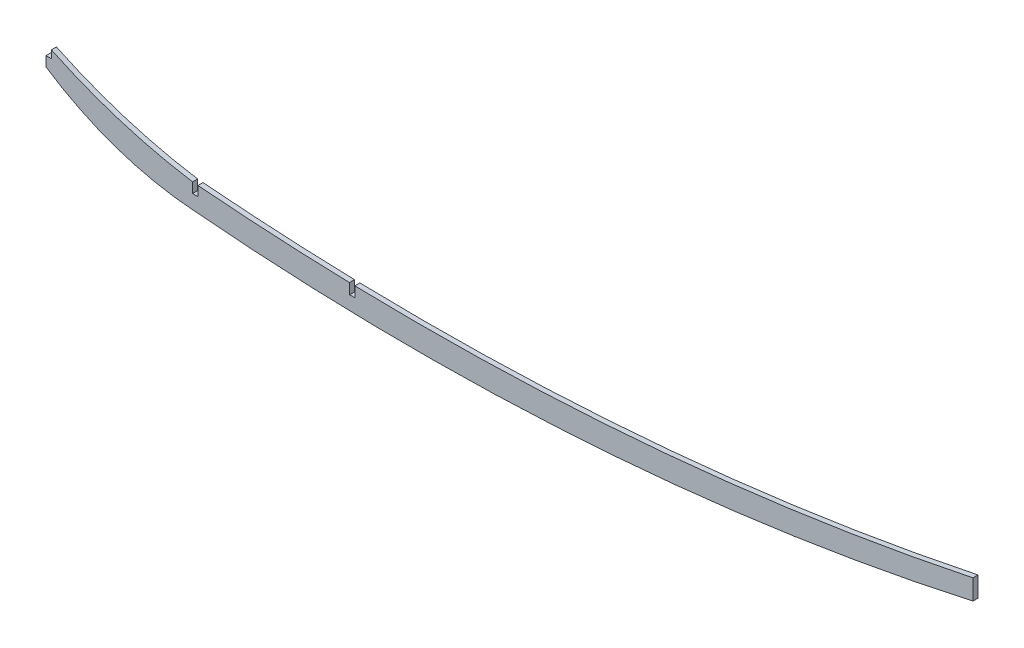
ISO-10303-21;
HEADER;
FILE_DESCRIPTION(('STEP AP214'),'2;1');
FILE_NAME('part.step','',(''),(''),'','','');
FILE_SCHEMA(('AUTOMOTIVE_DESIGN { 1 0 10303 214 1 1 1 1 }'));
ENDSEC;
DATA;
#1=APPLICATION_CONTEXT('core data for automotive mechanical design processes');
#2=APPLICATION_PROTOCOL_DEFINITION('international standard','automotive_design',2000,#1);
#3=PRODUCT_CONTEXT('',#1,'mechanical');
#4=PRODUCT('Part','Part','',(#3));
#5=PRODUCT_RELATED_PRODUCT_CATEGORY('part','',(#4));
#6=PRODUCT_DEFINITION_FORMATION('','',#4);
#7=PRODUCT_DEFINITION_CONTEXT('part definition',#1,'design');
#8=PRODUCT_DEFINITION('design','',#6,#7);
#9=PRODUCT_DEFINITION_SHAPE('','',#8);
#10=(LENGTH_UNIT() NAMED_UNIT(*) SI_UNIT(.MILLI.,.METRE.));
#11=(NAMED_UNIT(*) PLANE_ANGLE_UNIT() SI_UNIT($,.RADIAN.));
#12=(NAMED_UNIT(*) SI_UNIT($,.STERADIAN.) SOLID_ANGLE_UNIT());
#13=UNCERTAINTY_MEASURE_WITH_UNIT(LENGTH_MEASURE(1.E-05),#10,'distance_accuracy_value','');
#14=(GEOMETRIC_REPRESENTATION_CONTEXT(3) GLOBAL_UNCERTAINTY_ASSIGNED_CONTEXT((#13)) GLOBAL_UNIT_ASSIGNED_CONTEXT((#10,
#11,#12)) REPRESENTATION_CONTEXT('',''));
#15=CARTESIAN_POINT('',(0.,0.,0.));
#16=DIRECTION('',(0.,0.,1.));
#17=DIRECTION('',(1.,0.,0.));
#18=AXIS2_PLACEMENT_3D('',#15,#16,#17);
#19=CARTESIAN_POINT('',(236.552383189197,1575.13597472044,1.5875));
#20=DIRECTION('',(0.,0.,-1.));
#21=DIRECTION('',(-1.,0.,0.));
#22=AXIS2_PLACEMENT_3D('',#19,#20,#21);
#23=CYLINDRICAL_SURFACE('',#22,1695.3252939989);
#24=DIRECTION('',(0.,0.,-1.));
#25=VECTOR('',#24,1.);
#26=CARTESIAN_POINT('',(95.6691,-114.325404829356,1.5875));
#27=LINE('',#26,#25);
#28=CARTESIAN_POINT('',(95.6691,-114.325404829356,1.5875));
#29=VERTEX_POINT('',#28);
#30=CARTESIAN_POINT('',(95.6691,-114.325404829356,-1.5875));
#31=VERTEX_POINT('',#30);
#32=EDGE_CURVE('E211',#29,#31,#27,.T.);
#33=ORIENTED_EDGE('',*,*,#32,.F.);
#34=CARTESIAN_POINT('',(236.552383189197,1575.13597472044,1.5875));
#35=DIRECTION('',(0.,0.,1.));
#36=DIRECTION('',(1.,0.,0.));
#37=AXIS2_PLACEMENT_3D('',#34,#35,#36);
#38=CIRCLE('',#37,1695.3252939989);
#39=CARTESIAN_POINT('',(191.016824912201,-119.57767820293,1.5875));
#40=VERTEX_POINT('',#39);
#41=EDGE_CURVE('E210',#29,#40,#38,.T.);
#42=ORIENTED_EDGE('',*,*,#41,.T.);
#43=DIRECTION('',(0.,0.,-1.));
#44=VECTOR('',#43,1.);
#45=CARTESIAN_POINT('',(191.016824912201,-119.57767820293,1.5875));
#46=LINE('',#45,#44);
#47=CARTESIAN_POINT('',(191.016824912201,-119.57767820293,-1.5875));
#48=VERTEX_POINT('',#47);
#49=EDGE_CURVE('E202',#48,#40,#46,.F.);
#50=ORIENTED_EDGE('',*,*,#49,.F.);
#51=CARTESIAN_POINT('',(236.552383189197,1575.13597472044,-1.5875));
#52=DIRECTION('',(0.,0.,1.));
#53=DIRECTION('',(1.,0.,0.));
#54=AXIS2_PLACEMENT_3D('',#51,#52,#53);
#55=CIRCLE('',#54,1695.3252939989);
#56=EDGE_CURVE('E172',#31,#48,#55,.T.);
#57=ORIENTED_EDGE('',*,*,#56,.F.);
#58=EDGE_LOOP('',(#33,#42,#50,#57));
#59=FACE_BOUND('',#58,.T.);
#60=ADVANCED_FACE('F38',(#59),#23,.F.);
#61=DIRECTION('',(0.,0.,-1.));
#62=VECTOR('',#61,1.);
#63=CARTESIAN_POINT('',(194.39759616352,-119.665142344122,1.5875));
#64=LINE('',#63,#62);
#65=CARTESIAN_POINT('',(194.39759616352,-119.665142344123,1.5875));
#66=VERTEX_POINT('',#65);
#67=CARTESIAN_POINT('',(194.39759616352,-119.665142344123,-1.5875));
#68=VERTEX_POINT('',#67);
#69=EDGE_CURVE('E212',#66,#68,#64,.T.);
#70=ORIENTED_EDGE('',*,*,#69,.F.);
#71=CARTESIAN_POINT('',(583.522463963637,-84.3035738982637,1.5875));
#72=VERTEX_POINT('',#71);
#73=EDGE_CURVE('E180',#66,#72,#38,.T.);
#74=ORIENTED_EDGE('',*,*,#73,.T.);
#75=DIRECTION('',(0.,0.,-1.));
#76=VECTOR('',#75,1.);
#77=CARTESIAN_POINT('',(583.522463963637,-84.3035738982637,1.5875));
#78=LINE('',#77,#76);
#79=CARTESIAN_POINT('',(583.522463963637,-84.3035738982637,-1.5875));
#80=VERTEX_POINT('',#79);
#81=EDGE_CURVE('E181',#72,#80,#78,.T.);
#82=ORIENTED_EDGE('',*,*,#81,.T.);
#83=EDGE_CURVE('E222',#68,#80,#55,.T.);
#84=ORIENTED_EDGE('',*,*,#83,.F.);
#85=EDGE_LOOP('',(#70,#74,#82,#84));
#86=FACE_BOUND('',#85,.T.);
#87=ADVANCED_FACE('F40',(#86),#23,.F.);
#88=CARTESIAN_POINT('',(142.023725714652,203.900083427084,1.5875));
#89=DIRECTION('',(0.,0.,-1.));
#90=DIRECTION('',(-1.,0.,0.));
#91=AXIS2_PLACEMENT_3D('',#88,#89,#90);
#92=CYLINDRICAL_SURFACE('',#91,321.799409137231);
#93=DIRECTION('',(0.,0.,-1.));
#94=VECTOR('',#93,1.);
#95=CARTESIAN_POINT('',(3.37819999999972,-86.5001196038001,1.5875));
#96=LINE('',#95,#94);
#97=CARTESIAN_POINT('',(3.37819999999973,-86.5001196038001,1.5875));
#98=VERTEX_POINT('',#97);
#99=CARTESIAN_POINT('',(3.37819999999973,-86.5001196038001,-1.5875));
#100=VERTEX_POINT('',#99);
#101=EDGE_CURVE('E220',#98,#100,#96,.T.);
#102=ORIENTED_EDGE('',*,*,#101,.F.);
#103=CARTESIAN_POINT('',(142.023725714652,203.900083427084,1.5875));
#104=DIRECTION('',(0.,0.,1.));
#105=DIRECTION('',(1.,0.,0.));
#106=AXIS2_PLACEMENT_3D('',#103,#104,#105);
#107=CIRCLE('',#106,321.799409137231);
#108=CARTESIAN_POINT('',(92.2909,-114.033094721261,1.5875));
#109=VERTEX_POINT('',#108);
#110=EDGE_CURVE('E224',#98,#109,#107,.T.);
#111=ORIENTED_EDGE('',*,*,#110,.T.);
#112=DIRECTION('',(0.,0.,-1.));
#113=VECTOR('',#112,1.);
#114=CARTESIAN_POINT('',(92.2909,-114.033094721261,1.5875));
#115=LINE('',#114,#113);
#116=CARTESIAN_POINT('',(92.2909,-114.033094721261,-1.5875));
#117=VERTEX_POINT('',#116);
#118=EDGE_CURVE('E214',#117,#109,#115,.F.);
#119=ORIENTED_EDGE('',*,*,#118,.F.);
#120=CARTESIAN_POINT('',(142.023725714652,203.900083427084,-1.5875));
#121=DIRECTION('',(0.,0.,1.));
#122=DIRECTION('',(1.,0.,0.));
#123=AXIS2_PLACEMENT_3D('',#120,#121,#122);
#124=CIRCLE('',#123,321.799409137231);
#125=EDGE_CURVE('E167',#100,#117,#124,.T.);
#126=ORIENTED_EDGE('',*,*,#125,.F.);
#127=EDGE_LOOP('',(#102,#111,#119,#126));
#128=FACE_BOUND('',#127,.T.);
#129=ADVANCED_FACE('F308',(#128),#92,.F.);
#130=CARTESIAN_POINT('',(-2.22640957886562E-13,0.,1.5875));
#131=DIRECTION('',(-1.,0.,0.));
#132=DIRECTION('',(0.,-1.,0.));
#133=AXIS2_PLACEMENT_3D('',#130,#131,#132);
#134=PLANE('',#133);
#135=DIRECTION('',(0.,0.,1.));
#136=VECTOR('',#135,1.);
#137=CARTESIAN_POINT('',(-2.68898460419739E-13,-91.3400046835682,-1.5875));
#138=LINE('',#137,#136);
#139=CARTESIAN_POINT('',(-2.68898460419739E-13,-91.3400046835682,-1.5875));
#140=VERTEX_POINT('',#139);
#141=CARTESIAN_POINT('',(-2.68898460419739E-13,-91.3400046835682,1.5875));
#142=VERTEX_POINT('',#141);
#143=EDGE_CURVE('E148',#140,#142,#138,.T.);
#144=ORIENTED_EDGE('',*,*,#143,.F.);
#145=DIRECTION('',(0.,1.,0.));
#146=VECTOR('',#145,1.);
#147=CARTESIAN_POINT('',(-2.22640957886562E-13,0.,-1.5875));
#148=LINE('',#147,#146);
#149=CARTESIAN_POINT('',(-2.75821032680312E-13,-97.5630046835681,-1.5875));
#150=VERTEX_POINT('',#149);
#151=EDGE_CURVE('E159',#150,#140,#148,.T.);
#152=ORIENTED_EDGE('',*,*,#151,.F.);
#153=DIRECTION('',(0.,0.,-1.));
#154=VECTOR('',#153,1.);
#155=CARTESIAN_POINT('',(-2.75821032680312E-13,-97.5630046835681,1.5875));
#156=LINE('',#155,#154);
#157=CARTESIAN_POINT('',(-2.75821032680312E-13,-97.5630046835681,1.5875));
#158=VERTEX_POINT('',#157);
#159=EDGE_CURVE('E191',#158,#150,#156,.T.);
#160=ORIENTED_EDGE('',*,*,#159,.F.);
#161=DIRECTION('',(0.,1.,0.));
#162=VECTOR('',#161,1.);
#163=CARTESIAN_POINT('',(-2.22640957886562E-13,0.,1.5875));
#164=LINE('',#163,#162);
#165=EDGE_CURVE('E161',#158,#142,#164,.T.);
#166=ORIENTED_EDGE('',*,*,#165,.T.);
#167=EDGE_LOOP('',(#144,#152,#160,#166));
#168=FACE_BOUND('',#167,.T.);
#169=ADVANCED_FACE('F158',(#168),#134,.T.);
#170=CARTESIAN_POINT('',(106.917579146808,63.4069370940165,1.5875));
#171=DIRECTION('',(0.,0.,-1.));
#172=DIRECTION('',(-1.,0.,0.));
#173=AXIS2_PLACEMENT_3D('',#170,#171,#172);
#174=CYLINDRICAL_SURFACE('',#173,193.242570068018);
#175=CARTESIAN_POINT('',(106.917579146808,63.4069370940165,-1.5875));
#176=DIRECTION('',(0.,0.,1.));
#177=DIRECTION('',(1.,0.,0.));
#178=AXIS2_PLACEMENT_3D('',#175,#176,#177);
#179=CIRCLE('',#178,193.242570068018);
#180=CARTESIAN_POINT('',(92.3925000000007,-129.288970912023,-1.5875));
#181=VERTEX_POINT('',#180);
#182=EDGE_CURVE('E166',#150,#181,#179,.T.);
#183=ORIENTED_EDGE('',*,*,#182,.T.);
#184=DIRECTION('',(0.,0.,-1.));
#185=VECTOR('',#184,1.);
#186=CARTESIAN_POINT('',(92.3925000000007,-129.288970912023,1.5875));
#187=LINE('',#186,#185);
#188=CARTESIAN_POINT('',(92.3925000000007,-129.288970912023,1.5875));
#189=VERTEX_POINT('',#188);
#190=EDGE_CURVE('E188',#189,#181,#187,.T.);
#191=ORIENTED_EDGE('',*,*,#190,.F.);
#192=CARTESIAN_POINT('',(106.917579146808,63.4069370940165,1.5875));
#193=DIRECTION('',(0.,0.,1.));
#194=DIRECTION('',(1.,0.,0.));
#195=AXIS2_PLACEMENT_3D('',#192,#193,#194);
#196=CIRCLE('',#195,193.242570068018);
#197=EDGE_CURVE('E228',#158,#189,#196,.T.);
#198=ORIENTED_EDGE('',*,*,#197,.F.);
#199=ORIENTED_EDGE('',*,*,#159,.T.);
#200=EDGE_LOOP('',(#183,#191,#198,#199));
#201=FACE_BOUND('',#200,.T.);
#202=ADVANCED_FACE('F250',(#201),#174,.T.);
#203=CARTESIAN_POINT('',(233.579462378437,1474.66672504871,1.5875));
#204=DIRECTION('',(0.,0.,-1.));
#205=DIRECTION('',(-1.,0.,0.));
#206=AXIS2_PLACEMENT_3D('',#203,#204,#205);
#207=CYLINDRICAL_SURFACE('',#206,1610.15764226691);
#208=CARTESIAN_POINT('',(233.579462378437,1474.66672504871,-1.5875));
#209=DIRECTION('',(0.,0.,1.));
#210=DIRECTION('',(1.,0.,0.));
#211=AXIS2_PLACEMENT_3D('',#208,#209,#210);
#212=CIRCLE('',#211,1610.15764226691);
#213=CARTESIAN_POINT('',(583.522463963637,-97.0035738982638,-1.5875));
#214=VERTEX_POINT('',#213);
#215=EDGE_CURVE('E169',#181,#214,#212,.T.);
#216=ORIENTED_EDGE('',*,*,#215,.T.);
#217=DIRECTION('',(0.,0.,-1.));
#218=VECTOR('',#217,1.);
#219=CARTESIAN_POINT('',(583.522463963637,-97.0035738982638,1.5875));
#220=LINE('',#219,#218);
#221=CARTESIAN_POINT('',(583.522463963637,-97.0035738982638,1.5875));
#222=VERTEX_POINT('',#221);
#223=EDGE_CURVE('E184',#222,#214,#220,.T.);
#224=ORIENTED_EDGE('',*,*,#223,.F.);
#225=CARTESIAN_POINT('',(233.579462378437,1474.66672504871,1.5875));
#226=DIRECTION('',(0.,0.,1.));
#227=DIRECTION('',(1.,0.,0.));
#228=AXIS2_PLACEMENT_3D('',#225,#226,#227);
#229=CIRCLE('',#228,1610.15764226691);
#230=EDGE_CURVE('E230',#189,#222,#229,.T.);
#231=ORIENTED_EDGE('',*,*,#230,.F.);
#232=ORIENTED_EDGE('',*,*,#190,.T.);
#233=EDGE_LOOP('',(#216,#224,#231,#232));
#234=FACE_BOUND('',#233,.T.);
#235=ADVANCED_FACE('F246',(#234),#207,.T.);
#236=CARTESIAN_POINT('',(583.522463963637,0.,1.5875));
#237=DIRECTION('',(-1.,0.,0.));
#238=DIRECTION('',(0.,0.,1.));
#239=AXIS2_PLACEMENT_3D('',#236,#237,#238);
#240=PLANE('',#239);
#241=DIRECTION('',(0.,1.,0.));
#242=VECTOR('',#241,1.);
#243=CARTESIAN_POINT('',(583.522463963637,0.,-1.5875));
#244=LINE('',#243,#242);
#245=EDGE_CURVE('E177',#214,#80,#244,.T.);
#246=ORIENTED_EDGE('',*,*,#245,.T.);
#247=ORIENTED_EDGE('',*,*,#81,.F.);
#248=DIRECTION('',(0.,1.,0.));
#249=VECTOR('',#248,1.);
#250=CARTESIAN_POINT('',(583.522463963637,0.,1.5875));
#251=LINE('',#250,#249);
#252=EDGE_CURVE('E185',#222,#72,#251,.T.);
#253=ORIENTED_EDGE('',*,*,#252,.F.);
#254=ORIENTED_EDGE('',*,*,#223,.T.);
#255=EDGE_LOOP('',(#246,#247,#253,#254));
#256=FACE_BOUND('',#255,.T.);
#257=ADVANCED_FACE('F242',(#256),#240,.F.);
#258=CARTESIAN_POINT('',(0.,0.,1.5875));
#259=DIRECTION('',(0.,0.,1.));
#260=DIRECTION('',(1.,0.,0.));
#261=AXIS2_PLACEMENT_3D('',#258,#259,#260);
#262=PLANE('',#261);
#263=DIRECTION('',(0.,1.,0.));
#264=VECTOR('',#263,1.);
#265=CARTESIAN_POINT('',(3.37819999999973,-84.8630046835681,1.5875));
#266=LINE('',#265,#264);
#267=CARTESIAN_POINT('',(3.37819999999973,-91.3400046835682,1.5875));
#268=VERTEX_POINT('',#267);
#269=EDGE_CURVE('E153',#268,#98,#266,.T.);
#270=ORIENTED_EDGE('',*,*,#269,.F.);
#271=DIRECTION('',(1.,0.,0.));
#272=VECTOR('',#271,1.);
#273=CARTESIAN_POINT('',(-2.68898460419739E-13,-91.3400046835682,1.5875));
#274=LINE('',#273,#272);
#275=EDGE_CURVE('E254',#142,#268,#274,.T.);
#276=ORIENTED_EDGE('',*,*,#275,.F.);
#277=ORIENTED_EDGE('',*,*,#165,.F.);
#278=ORIENTED_EDGE('',*,*,#197,.T.);
#279=ORIENTED_EDGE('',*,*,#230,.T.);
#280=ORIENTED_EDGE('',*,*,#252,.T.);
#281=ORIENTED_EDGE('',*,*,#73,.F.);
#282=DIRECTION('',(-0.0209302977678912,0.999780937323446,0.));
#283=VECTOR('',#282,1.);
#284=CARTESIAN_POINT('',(194.532828757834,-126.124819669298,1.5875));
#285=LINE('',#284,#283);
#286=CARTESIAN_POINT('',(194.532828757834,-126.124819669298,1.5875));
#287=VERTEX_POINT('',#286);
#288=EDGE_CURVE('E281',#287,#66,#285,.T.);
#289=ORIENTED_EDGE('',*,*,#288,.F.);
#290=DIRECTION('',(0.999780937323446,0.0209302977678943,0.));
#291=VECTOR('',#290,1.);
#292=CARTESIAN_POINT('',(191.155368795368,-126.195526401217,1.5875));
#293=LINE('',#292,#291);
#294=CARTESIAN_POINT('',(191.155368795368,-126.195526401217,1.5875));
#295=VERTEX_POINT('',#294);
#296=EDGE_CURVE('E283',#295,#287,#293,.T.);
#297=ORIENTED_EDGE('',*,*,#296,.F.);
#298=DIRECTION('',(0.0209302977678912,-0.999780937323445,0.));
#299=VECTOR('',#298,1.);
#300=CARTESIAN_POINT('',(191.155368795368,-126.195526401217,1.5875));
#301=LINE('',#300,#299);
#302=EDGE_CURVE('E269',#40,#295,#301,.T.);
#303=ORIENTED_EDGE('',*,*,#302,.F.);
#304=ORIENTED_EDGE('',*,*,#41,.F.);
#305=DIRECTION('',(0.,1.,0.));
#306=VECTOR('',#305,1.);
#307=CARTESIAN_POINT('',(95.6691,-120.415791429802,1.5875));
#308=LINE('',#307,#306);
#309=CARTESIAN_POINT('',(95.6691,-120.415791429802,1.5875));
#310=VERTEX_POINT('',#309);
#311=EDGE_CURVE('E270',#310,#29,#308,.T.);
#312=ORIENTED_EDGE('',*,*,#311,.F.);
#313=DIRECTION('',(1.,0.,0.));
#314=VECTOR('',#313,1.);
#315=CARTESIAN_POINT('',(92.2909,-120.415791429802,1.5875));
#316=LINE('',#315,#314);
#317=CARTESIAN_POINT('',(92.2909,-120.415791429802,1.5875));
#318=VERTEX_POINT('',#317);
#319=EDGE_CURVE('E259',#318,#310,#316,.T.);
#320=ORIENTED_EDGE('',*,*,#319,.F.);
#321=DIRECTION('',(0.,-1.,0.));
#322=VECTOR('',#321,1.);
#323=CARTESIAN_POINT('',(92.2909,-120.415791429802,1.5875));
#324=LINE('',#323,#322);
#325=EDGE_CURVE('E256',#109,#318,#324,.T.);
#326=ORIENTED_EDGE('',*,*,#325,.F.);
#327=ORIENTED_EDGE('',*,*,#110,.F.);
#328=EDGE_LOOP('',(#270,#276,#277,#278,#279,#280,#281,#289,#297,#303,#304,#312,#320,#326,#327));
#329=FACE_BOUND('',#328,.T.);
#330=ADVANCED_FACE('F253',(#329),#262,.T.);
#331=CARTESIAN_POINT('',(0.,0.,-1.5875));
#332=DIRECTION('',(0.,0.,1.));
#333=DIRECTION('',(1.,0.,0.));
#334=AXIS2_PLACEMENT_3D('',#331,#332,#333);
#335=PLANE('',#334);
#336=DIRECTION('',(1.,0.,0.));
#337=VECTOR('',#336,1.);
#338=CARTESIAN_POINT('',(-2.68898460419739E-13,-91.3400046835682,-1.5875));
#339=LINE('',#338,#337);
#340=CARTESIAN_POINT('',(3.37819999999973,-91.3400046835682,-1.5875));
#341=VERTEX_POINT('',#340);
#342=EDGE_CURVE('E144',#140,#341,#339,.T.);
#343=ORIENTED_EDGE('',*,*,#342,.T.);
#344=DIRECTION('',(0.,1.,0.));
#345=VECTOR('',#344,1.);
#346=CARTESIAN_POINT('',(3.37819999999973,-84.8630046835681,-1.5875));
#347=LINE('',#346,#345);
#348=EDGE_CURVE('E53',#341,#100,#347,.T.);
#349=ORIENTED_EDGE('',*,*,#348,.T.);
#350=ORIENTED_EDGE('',*,*,#125,.T.);
#351=DIRECTION('',(0.,-1.,0.));
#352=VECTOR('',#351,1.);
#353=CARTESIAN_POINT('',(92.2909,0.,-1.5875));
#354=LINE('',#353,#352);
#355=CARTESIAN_POINT('',(92.2909,-120.415791429802,-1.5875));
#356=VERTEX_POINT('',#355);
#357=EDGE_CURVE('E11',#117,#356,#354,.T.);
#358=ORIENTED_EDGE('',*,*,#357,.T.);
#359=DIRECTION('',(1.,0.,0.));
#360=VECTOR('',#359,1.);
#361=CARTESIAN_POINT('',(92.2909,-120.415791429802,-1.5875));
#362=LINE('',#361,#360);
#363=CARTESIAN_POINT('',(95.6691,-120.415791429802,-1.5875));
#364=VERTEX_POINT('',#363);
#365=EDGE_CURVE('E272',#356,#364,#362,.T.);
#366=ORIENTED_EDGE('',*,*,#365,.T.);
#367=DIRECTION('',(0.,1.,0.));
#368=VECTOR('',#367,1.);
#369=CARTESIAN_POINT('',(95.6691,-120.415791429802,-1.5875));
#370=LINE('',#369,#368);
#371=EDGE_CURVE('E61',#364,#31,#370,.T.);
#372=ORIENTED_EDGE('',*,*,#371,.T.);
#373=ORIENTED_EDGE('',*,*,#56,.T.);
#374=DIRECTION('',(0.0209302977678912,-0.999780937323446,0.));
#375=VECTOR('',#374,1.);
#376=CARTESIAN_POINT('',(188.43089662304,3.9447789288215,-1.5875));
#377=LINE('',#376,#375);
#378=CARTESIAN_POINT('',(191.155368795368,-126.195526401217,-1.5875));
#379=VERTEX_POINT('',#378);
#380=EDGE_CURVE('E46',#48,#379,#377,.T.);
#381=ORIENTED_EDGE('',*,*,#380,.T.);
#382=DIRECTION('',(0.999780937323446,0.0209302977678943,0.));
#383=VECTOR('',#382,1.);
#384=CARTESIAN_POINT('',(191.155368795368,-126.195526401217,-1.5875));
#385=LINE('',#384,#383);
#386=CARTESIAN_POINT('',(194.532828757834,-126.124819669298,-1.5875));
#387=VERTEX_POINT('',#386);
#388=EDGE_CURVE('E197',#379,#387,#385,.T.);
#389=ORIENTED_EDGE('',*,*,#388,.T.);
#390=DIRECTION('',(-0.0209302977678912,0.999780937323446,0.));
#391=VECTOR('',#390,1.);
#392=CARTESIAN_POINT('',(194.532828757834,-126.124819669298,-1.5875));
#393=LINE('',#392,#391);
#394=EDGE_CURVE('E235',#387,#68,#393,.T.);
#395=ORIENTED_EDGE('',*,*,#394,.T.);
#396=ORIENTED_EDGE('',*,*,#83,.T.);
#397=ORIENTED_EDGE('',*,*,#245,.F.);
#398=ORIENTED_EDGE('',*,*,#215,.F.);
#399=ORIENTED_EDGE('',*,*,#182,.F.);
#400=ORIENTED_EDGE('',*,*,#151,.T.);
#401=EDGE_LOOP('',(#343,#349,#350,#358,#366,#372,#373,#381,#389,#395,#396,#397,#398,#399,#400));
#402=FACE_BOUND('',#401,.T.);
#403=ADVANCED_FACE('F164',(#402),#335,.F.);
#404=CARTESIAN_POINT('',(191.155368795368,-126.195526401217,-1.5875));
#405=DIRECTION('',(-0.999780937323446,-0.0209302977678912,0.));
#406=DIRECTION('',(0.0209302977678912,-0.999780937323446,0.));
#407=AXIS2_PLACEMENT_3D('',#404,#405,#406);
#408=PLANE('',#407);
#409=ORIENTED_EDGE('',*,*,#49,.T.);
#410=ORIENTED_EDGE('',*,*,#302,.T.);
#411=DIRECTION('',(0.,0.,1.));
#412=VECTOR('',#411,1.);
#413=CARTESIAN_POINT('',(191.155368795368,-126.195526401217,-1.5875));
#414=LINE('',#413,#412);
#415=EDGE_CURVE('E205',#379,#295,#414,.T.);
#416=ORIENTED_EDGE('',*,*,#415,.F.);
#417=ORIENTED_EDGE('',*,*,#380,.F.);
#418=EDGE_LOOP('',(#409,#410,#416,#417));
#419=FACE_BOUND('',#418,.T.);
#420=ADVANCED_FACE('F201',(#419),#408,.F.);
#421=CARTESIAN_POINT('',(194.532828757834,-126.124819669298,-1.5875));
#422=DIRECTION('',(0.999780937323446,0.0209302977678912,0.));
#423=DIRECTION('',(-0.0209302977678912,0.999780937323446,0.));
#424=AXIS2_PLACEMENT_3D('',#421,#422,#423);
#425=PLANE('',#424);
#426=ORIENTED_EDGE('',*,*,#69,.T.);
#427=ORIENTED_EDGE('',*,*,#394,.F.);
#428=DIRECTION('',(0.,0.,1.));
#429=VECTOR('',#428,1.);
#430=CARTESIAN_POINT('',(194.532828757834,-126.124819669298,-1.5875));
#431=LINE('',#430,#429);
#432=EDGE_CURVE('E279',#387,#287,#431,.T.);
#433=ORIENTED_EDGE('',*,*,#432,.T.);
#434=ORIENTED_EDGE('',*,*,#288,.T.);
#435=EDGE_LOOP('',(#426,#427,#433,#434));
#436=FACE_BOUND('',#435,.T.);
#437=ADVANCED_FACE('F293',(#436),#425,.F.);
#438=CARTESIAN_POINT('',(191.155368795368,-126.195526401217,-1.5875));
#439=DIRECTION('',(0.0209302977678943,-0.999780937323446,0.));
#440=DIRECTION('',(0.999780937323446,0.0209302977678943,0.));
#441=AXIS2_PLACEMENT_3D('',#438,#439,#440);
#442=PLANE('',#441);
#443=ORIENTED_EDGE('',*,*,#296,.T.);
#444=ORIENTED_EDGE('',*,*,#432,.F.);
#445=ORIENTED_EDGE('',*,*,#388,.F.);
#446=ORIENTED_EDGE('',*,*,#415,.T.);
#447=EDGE_LOOP('',(#443,#444,#445,#446));
#448=FACE_BOUND('',#447,.T.);
#449=ADVANCED_FACE('F289',(#448),#442,.F.);
#450=CARTESIAN_POINT('',(92.2909,-120.415791429802,-1.5875));
#451=DIRECTION('',(-1.,0.,0.));
#452=DIRECTION('',(0.,0.,1.));
#453=AXIS2_PLACEMENT_3D('',#450,#451,#452);
#454=PLANE('',#453);
#455=ORIENTED_EDGE('',*,*,#118,.T.);
#456=ORIENTED_EDGE('',*,*,#325,.T.);
#457=DIRECTION('',(0.,0.,1.));
#458=VECTOR('',#457,1.);
#459=CARTESIAN_POINT('',(92.2909,-120.415791429802,-1.5875));
#460=LINE('',#459,#458);
#461=EDGE_CURVE('E264',#356,#318,#460,.T.);
#462=ORIENTED_EDGE('',*,*,#461,.F.);
#463=ORIENTED_EDGE('',*,*,#357,.F.);
#464=EDGE_LOOP('',(#455,#456,#462,#463));
#465=FACE_BOUND('',#464,.T.);
#466=ADVANCED_FACE('F300',(#465),#454,.F.);
#467=CARTESIAN_POINT('',(95.6691,-120.415791429802,-1.5875));
#468=DIRECTION('',(1.,0.,0.));
#469=DIRECTION('',(0.,0.,-1.));
#470=AXIS2_PLACEMENT_3D('',#467,#468,#469);
#471=PLANE('',#470);
#472=ORIENTED_EDGE('',*,*,#32,.T.);
#473=ORIENTED_EDGE('',*,*,#371,.F.);
#474=DIRECTION('',(0.,0.,1.));
#475=VECTOR('',#474,1.);
#476=CARTESIAN_POINT('',(95.6691,-120.415791429802,-1.5875));
#477=LINE('',#476,#475);
#478=EDGE_CURVE('E267',#364,#310,#477,.T.);
#479=ORIENTED_EDGE('',*,*,#478,.T.);
#480=ORIENTED_EDGE('',*,*,#311,.T.);
#481=EDGE_LOOP('',(#472,#473,#479,#480));
#482=FACE_BOUND('',#481,.T.);
#483=ADVANCED_FACE('F363',(#482),#471,.F.);
#484=CARTESIAN_POINT('',(92.2909,-120.415791429802,-1.5875));
#485=DIRECTION('',(0.,-1.,0.));
#486=DIRECTION('',(0.,0.,-1.));
#487=AXIS2_PLACEMENT_3D('',#484,#485,#486);
#488=PLANE('',#487);
#489=ORIENTED_EDGE('',*,*,#319,.T.);
#490=ORIENTED_EDGE('',*,*,#478,.F.);
#491=ORIENTED_EDGE('',*,*,#365,.F.);
#492=ORIENTED_EDGE('',*,*,#461,.T.);
#493=EDGE_LOOP('',(#489,#490,#491,#492));
#494=FACE_BOUND('',#493,.T.);
#495=ADVANCED_FACE('F374',(#494),#488,.F.);
#496=CARTESIAN_POINT('',(3.37819999999973,-84.8630046835681,-1.5875));
#497=DIRECTION('',(1.,0.,0.));
#498=DIRECTION('',(0.,0.,-1.));
#499=AXIS2_PLACEMENT_3D('',#496,#497,#498);
#500=PLANE('',#499);
#501=ORIENTED_EDGE('',*,*,#101,.T.);
#502=ORIENTED_EDGE('',*,*,#348,.F.);
#503=DIRECTION('',(0.,0.,1.));
#504=VECTOR('',#503,1.);
#505=CARTESIAN_POINT('',(3.37819999999973,-91.3400046835682,-1.5875));
#506=LINE('',#505,#504);
#507=EDGE_CURVE('E150',#341,#268,#506,.T.);
#508=ORIENTED_EDGE('',*,*,#507,.T.);
#509=ORIENTED_EDGE('',*,*,#269,.T.);
#510=EDGE_LOOP('',(#501,#502,#508,#509));
#511=FACE_BOUND('',#510,.T.);
#512=ADVANCED_FACE('F384',(#511),#500,.F.);
#513=CARTESIAN_POINT('',(-2.68898460419739E-13,-91.3400046835682,-1.5875));
#514=DIRECTION('',(0.,-1.,0.));
#515=DIRECTION('',(0.,0.,-1.));
#516=AXIS2_PLACEMENT_3D('',#513,#514,#515);
#517=PLANE('',#516);
#518=ORIENTED_EDGE('',*,*,#275,.T.);
#519=ORIENTED_EDGE('',*,*,#507,.F.);
#520=ORIENTED_EDGE('',*,*,#342,.F.);
#521=ORIENTED_EDGE('',*,*,#143,.T.);
#522=EDGE_LOOP('',(#518,#519,#520,#521));
#523=FACE_BOUND('',#522,.T.);
#524=ADVANCED_FACE('F147',(#523),#517,.F.);
#525=CLOSED_SHELL('',(#60,#87,#129,#169,#202,#235,#257,#330,#403,#420,#437,#449,#466,#483,#495,
#512,#524));
#526=MANIFOLD_SOLID_BREP('B2',#525);
#527=ADVANCED_BREP_SHAPE_REPRESENTATION('',(#18,#526),#14);
#528=SHAPE_DEFINITION_REPRESENTATION(#9,#527);
ENDSEC;
END-ISO-10303-21;
